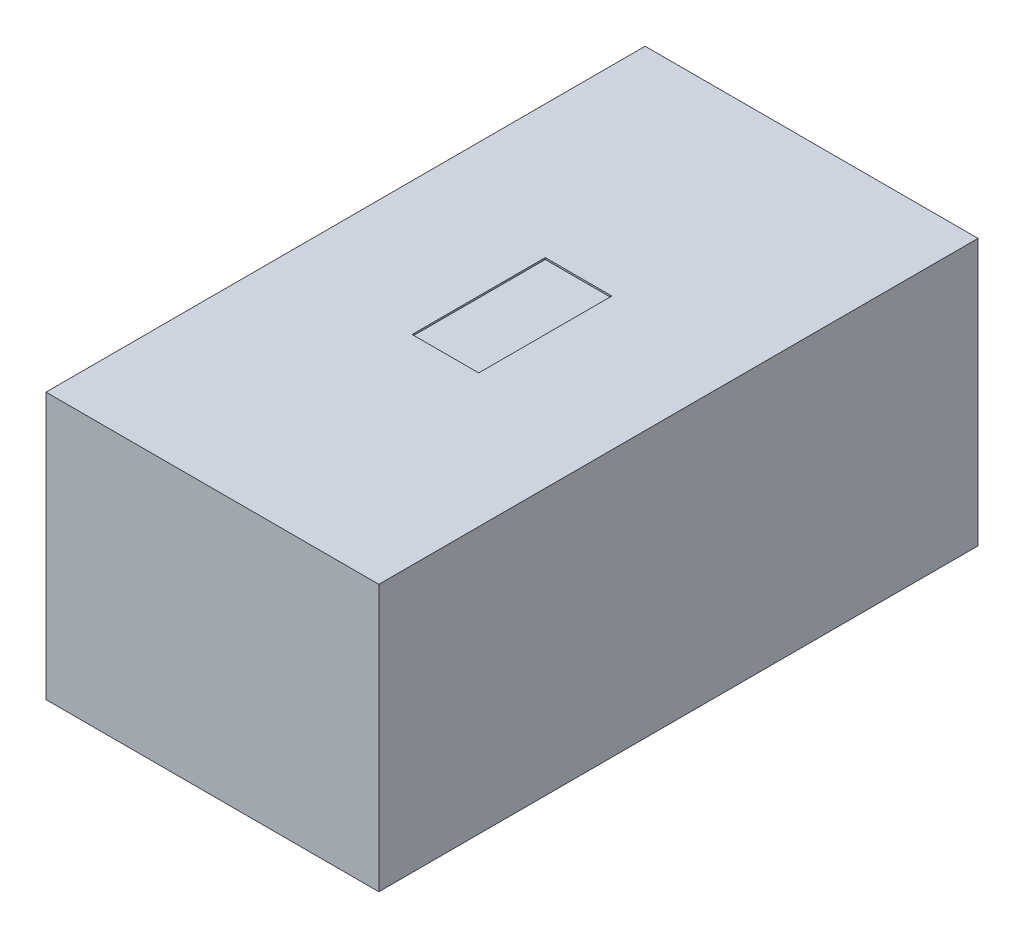
ISO-10303-21;
HEADER;
FILE_DESCRIPTION(('STEP AP214'),'2;1');
FILE_NAME('part.step','',(''),(''),'','','');
FILE_SCHEMA(('AUTOMOTIVE_DESIGN { 1 0 10303 214 1 1 1 1 }'));
ENDSEC;
DATA;
#1=APPLICATION_CONTEXT('core data for automotive mechanical design processes');
#2=APPLICATION_PROTOCOL_DEFINITION('international standard','automotive_design',2000,#1);
#3=PRODUCT_CONTEXT('',#1,'mechanical');
#4=PRODUCT('Part','Part','',(#3));
#5=PRODUCT_RELATED_PRODUCT_CATEGORY('part','',(#4));
#6=PRODUCT_DEFINITION_FORMATION('','',#4);
#7=PRODUCT_DEFINITION_CONTEXT('part definition',#1,'design');
#8=PRODUCT_DEFINITION('design','',#6,#7);
#9=PRODUCT_DEFINITION_SHAPE('','',#8);
#10=(LENGTH_UNIT() NAMED_UNIT(*) SI_UNIT(.MILLI.,.METRE.));
#11=(NAMED_UNIT(*) PLANE_ANGLE_UNIT() SI_UNIT($,.RADIAN.));
#12=(NAMED_UNIT(*) SI_UNIT($,.STERADIAN.) SOLID_ANGLE_UNIT());
#13=UNCERTAINTY_MEASURE_WITH_UNIT(LENGTH_MEASURE(1.E-05),#10,'distance_accuracy_value','');
#14=(GEOMETRIC_REPRESENTATION_CONTEXT(3) GLOBAL_UNCERTAINTY_ASSIGNED_CONTEXT((#13)) GLOBAL_UNIT_ASSIGNED_CONTEXT((#10,
#11,#12)) REPRESENTATION_CONTEXT('',''));
#15=CARTESIAN_POINT('',(0.,0.,0.));
#16=DIRECTION('',(0.,0.,1.));
#17=DIRECTION('',(1.,0.,0.));
#18=AXIS2_PLACEMENT_3D('',#15,#16,#17);
#19=CARTESIAN_POINT('',(0.5,0.8,-0.9));
#20=DIRECTION('',(-1.,0.,0.));
#21=DIRECTION('',(0.,0.,1.));
#22=AXIS2_PLACEMENT_3D('',#19,#20,#21);
#23=PLANE('',#22);
#24=DIRECTION('',(0.,0.,-1.));
#25=VECTOR('',#24,1.);
#26=CARTESIAN_POINT('',(0.5,0.,-0.9));
#27=LINE('',#26,#25);
#28=CARTESIAN_POINT('',(0.5,0.,0.9));
#29=VERTEX_POINT('',#28);
#30=CARTESIAN_POINT('',(0.5,0.,-0.9));
#31=VERTEX_POINT('',#30);
#32=EDGE_CURVE('E149',#29,#31,#27,.T.);
#33=ORIENTED_EDGE('',*,*,#32,.T.);
#34=DIRECTION('',(0.,-1.,0.));
#35=VECTOR('',#34,1.);
#36=CARTESIAN_POINT('',(0.5,0.8,-0.9));
#37=LINE('',#36,#35);
#38=CARTESIAN_POINT('',(0.5,0.8,-0.9));
#39=VERTEX_POINT('',#38);
#40=EDGE_CURVE('E11',#39,#31,#37,.T.);
#41=ORIENTED_EDGE('',*,*,#40,.F.);
#42=DIRECTION('',(0.,0.,-1.));
#43=VECTOR('',#42,1.);
#44=CARTESIAN_POINT('',(0.5,0.8,-0.9));
#45=LINE('',#44,#43);
#46=CARTESIAN_POINT('',(0.5,0.8,0.9));
#47=VERTEX_POINT('',#46);
#48=EDGE_CURVE('E153',#47,#39,#45,.T.);
#49=ORIENTED_EDGE('',*,*,#48,.F.);
#50=DIRECTION('',(0.,-1.,0.));
#51=VECTOR('',#50,1.);
#52=CARTESIAN_POINT('',(0.5,0.8,0.9));
#53=LINE('',#52,#51);
#54=EDGE_CURVE('E159',#47,#29,#53,.T.);
#55=ORIENTED_EDGE('',*,*,#54,.T.);
#56=EDGE_LOOP('',(#33,#41,#49,#55));
#57=FACE_BOUND('',#56,.T.);
#58=ADVANCED_FACE('F41',(#57),#23,.F.);
#59=CARTESIAN_POINT('',(-0.5,0.8,-0.9));
#60=DIRECTION('',(0.,0.,1.));
#61=DIRECTION('',(1.,0.,0.));
#62=AXIS2_PLACEMENT_3D('',#59,#60,#61);
#63=PLANE('',#62);
#64=DIRECTION('',(-1.,0.,0.));
#65=VECTOR('',#64,1.);
#66=CARTESIAN_POINT('',(-0.5,0.,-0.9));
#67=LINE('',#66,#65);
#68=CARTESIAN_POINT('',(-0.5,0.,-0.9));
#69=VERTEX_POINT('',#68);
#70=EDGE_CURVE('E162',#31,#69,#67,.T.);
#71=ORIENTED_EDGE('',*,*,#70,.T.);
#72=DIRECTION('',(0.,-1.,0.));
#73=VECTOR('',#72,1.);
#74=CARTESIAN_POINT('',(-0.5,0.8,-0.9));
#75=LINE('',#74,#73);
#76=CARTESIAN_POINT('',(-0.5,0.8,-0.9));
#77=VERTEX_POINT('',#76);
#78=EDGE_CURVE('E48',#77,#69,#75,.T.);
#79=ORIENTED_EDGE('',*,*,#78,.F.);
#80=DIRECTION('',(-1.,0.,0.));
#81=VECTOR('',#80,1.);
#82=CARTESIAN_POINT('',(-0.5,0.8,-0.9));
#83=LINE('',#82,#81);
#84=EDGE_CURVE('E92',#39,#77,#83,.T.);
#85=ORIENTED_EDGE('',*,*,#84,.F.);
#86=ORIENTED_EDGE('',*,*,#40,.T.);
#87=EDGE_LOOP('',(#71,#79,#85,#86));
#88=FACE_BOUND('',#87,.T.);
#89=ADVANCED_FACE('F192',(#88),#63,.F.);
#90=CARTESIAN_POINT('',(-0.5,0.8,-0.9));
#91=DIRECTION('',(1.,0.,0.));
#92=DIRECTION('',(0.,0.,-1.));
#93=AXIS2_PLACEMENT_3D('',#90,#91,#92);
#94=PLANE('',#93);
#95=DIRECTION('',(0.,0.,1.));
#96=VECTOR('',#95,1.);
#97=CARTESIAN_POINT('',(-0.5,0.,-0.9));
#98=LINE('',#97,#96);
#99=CARTESIAN_POINT('',(-0.5,0.,0.9));
#100=VERTEX_POINT('',#99);
#101=EDGE_CURVE('E164',#69,#100,#98,.T.);
#102=ORIENTED_EDGE('',*,*,#101,.T.);
#103=DIRECTION('',(0.,-1.,0.));
#104=VECTOR('',#103,1.);
#105=CARTESIAN_POINT('',(-0.5,0.8,0.9));
#106=LINE('',#105,#104);
#107=CARTESIAN_POINT('',(-0.5,0.8,0.9));
#108=VERTEX_POINT('',#107);
#109=EDGE_CURVE('E168',#108,#100,#106,.T.);
#110=ORIENTED_EDGE('',*,*,#109,.F.);
#111=DIRECTION('',(0.,0.,1.));
#112=VECTOR('',#111,1.);
#113=CARTESIAN_POINT('',(-0.5,0.8,-0.9));
#114=LINE('',#113,#112);
#115=EDGE_CURVE('E156',#77,#108,#114,.T.);
#116=ORIENTED_EDGE('',*,*,#115,.F.);
#117=ORIENTED_EDGE('',*,*,#78,.T.);
#118=EDGE_LOOP('',(#102,#110,#116,#117));
#119=FACE_BOUND('',#118,.T.);
#120=ADVANCED_FACE('F173',(#119),#94,.F.);
#121=CARTESIAN_POINT('',(-0.5,0.8,0.9));
#122=DIRECTION('',(0.,0.,-1.));
#123=DIRECTION('',(-1.,0.,0.));
#124=AXIS2_PLACEMENT_3D('',#121,#122,#123);
#125=PLANE('',#124);
#126=DIRECTION('',(1.,0.,0.));
#127=VECTOR('',#126,1.);
#128=CARTESIAN_POINT('',(-0.5,0.,0.9));
#129=LINE('',#128,#127);
#130=EDGE_CURVE('E85',#100,#29,#129,.T.);
#131=ORIENTED_EDGE('',*,*,#130,.T.);
#132=ORIENTED_EDGE('',*,*,#54,.F.);
#133=DIRECTION('',(1.,0.,0.));
#134=VECTOR('',#133,1.);
#135=CARTESIAN_POINT('',(-0.5,0.8,0.9));
#136=LINE('',#135,#134);
#137=EDGE_CURVE('E64',#108,#47,#136,.T.);
#138=ORIENTED_EDGE('',*,*,#137,.F.);
#139=ORIENTED_EDGE('',*,*,#109,.T.);
#140=EDGE_LOOP('',(#131,#132,#138,#139));
#141=FACE_BOUND('',#140,.T.);
#142=ADVANCED_FACE('F181',(#141),#125,.F.);
#143=CARTESIAN_POINT('',(0.,0.8,0.));
#144=DIRECTION('',(0.,1.,0.));
#145=DIRECTION('',(0.,0.,1.));
#146=AXIS2_PLACEMENT_3D('',#143,#144,#145);
#147=PLANE('',#146);
#148=DIRECTION('',(0.,0.,-1.));
#149=VECTOR('',#148,1.);
#150=CARTESIAN_POINT('',(0.1,0.8,-0.2));
#151=LINE('',#150,#149);
#152=CARTESIAN_POINT('',(0.1,0.8,0.2));
#153=VERTEX_POINT('',#152);
#154=CARTESIAN_POINT('',(0.1,0.8,-0.2));
#155=VERTEX_POINT('',#154);
#156=EDGE_CURVE('E55',#153,#155,#151,.T.);
#157=ORIENTED_EDGE('',*,*,#156,.F.);
#158=DIRECTION('',(1.,0.,0.));
#159=VECTOR('',#158,1.);
#160=CARTESIAN_POINT('',(-0.1,0.8,0.2));
#161=LINE('',#160,#159);
#162=CARTESIAN_POINT('',(-0.1,0.8,0.2));
#163=VERTEX_POINT('',#162);
#164=EDGE_CURVE('E134',#163,#153,#161,.T.);
#165=ORIENTED_EDGE('',*,*,#164,.F.);
#166=DIRECTION('',(0.,0.,1.));
#167=VECTOR('',#166,1.);
#168=CARTESIAN_POINT('',(-0.1,0.8,-0.2));
#169=LINE('',#168,#167);
#170=CARTESIAN_POINT('',(-0.1,0.8,-0.2));
#171=VERTEX_POINT('',#170);
#172=EDGE_CURVE('E137',#171,#163,#169,.T.);
#173=ORIENTED_EDGE('',*,*,#172,.F.);
#174=DIRECTION('',(-1.,0.,0.));
#175=VECTOR('',#174,1.);
#176=CARTESIAN_POINT('',(-0.1,0.8,-0.2));
#177=LINE('',#176,#175);
#178=EDGE_CURVE('E143',#155,#171,#177,.T.);
#179=ORIENTED_EDGE('',*,*,#178,.F.);
#180=EDGE_LOOP('',(#157,#165,#173,#179));
#181=FACE_BOUND('',#180,.T.);
#182=ORIENTED_EDGE('',*,*,#48,.T.);
#183=ORIENTED_EDGE('',*,*,#84,.T.);
#184=ORIENTED_EDGE('',*,*,#115,.T.);
#185=ORIENTED_EDGE('',*,*,#137,.T.);
#186=EDGE_LOOP('',(#182,#183,#184,#185));
#187=FACE_BOUND('',#186,.T.);
#188=ADVANCED_FACE('F183',(#181,#187),#147,.T.);
#189=CARTESIAN_POINT('',(0.,0.,0.));
#190=DIRECTION('',(0.,1.,0.));
#191=DIRECTION('',(0.,0.,1.));
#192=AXIS2_PLACEMENT_3D('',#189,#190,#191);
#193=PLANE('',#192);
#194=ORIENTED_EDGE('',*,*,#32,.F.);
#195=ORIENTED_EDGE('',*,*,#130,.F.);
#196=ORIENTED_EDGE('',*,*,#101,.F.);
#197=ORIENTED_EDGE('',*,*,#70,.F.);
#198=EDGE_LOOP('',(#194,#195,#196,#197));
#199=FACE_BOUND('',#198,.T.);
#200=ADVANCED_FACE('F177',(#199),#193,.F.);
#201=CARTESIAN_POINT('',(0.1,0.795,-0.2));
#202=DIRECTION('',(1.,0.,0.));
#203=DIRECTION('',(0.,0.,-1.));
#204=AXIS2_PLACEMENT_3D('',#201,#202,#203);
#205=PLANE('',#204);
#206=ORIENTED_EDGE('',*,*,#156,.T.);
#207=DIRECTION('',(0.,1.,0.));
#208=VECTOR('',#207,1.);
#209=CARTESIAN_POINT('',(0.1,0.795,-0.2));
#210=LINE('',#209,#208);
#211=CARTESIAN_POINT('',(0.1,0.795,-0.2));
#212=VERTEX_POINT('',#211);
#213=EDGE_CURVE('E112',#212,#155,#210,.T.);
#214=ORIENTED_EDGE('',*,*,#213,.F.);
#215=DIRECTION('',(0.,0.,-1.));
#216=VECTOR('',#215,1.);
#217=CARTESIAN_POINT('',(0.1,0.795,-0.2));
#218=LINE('',#217,#216);
#219=CARTESIAN_POINT('',(0.1,0.795,0.2));
#220=VERTEX_POINT('',#219);
#221=EDGE_CURVE('E116',#220,#212,#218,.T.);
#222=ORIENTED_EDGE('',*,*,#221,.F.);
#223=DIRECTION('',(0.,1.,0.));
#224=VECTOR('',#223,1.);
#225=CARTESIAN_POINT('',(0.1,0.795,0.2));
#226=LINE('',#225,#224);
#227=EDGE_CURVE('E147',#220,#153,#226,.T.);
#228=ORIENTED_EDGE('',*,*,#227,.T.);
#229=EDGE_LOOP('',(#206,#214,#222,#228));
#230=FACE_BOUND('',#229,.T.);
#231=ADVANCED_FACE('F114',(#230),#205,.F.);
#232=CARTESIAN_POINT('',(-0.1,0.795,0.2));
#233=DIRECTION('',(0.,0.,1.));
#234=DIRECTION('',(1.,0.,0.));
#235=AXIS2_PLACEMENT_3D('',#232,#233,#234);
#236=PLANE('',#235);
#237=ORIENTED_EDGE('',*,*,#164,.T.);
#238=ORIENTED_EDGE('',*,*,#227,.F.);
#239=DIRECTION('',(1.,0.,0.));
#240=VECTOR('',#239,1.);
#241=CARTESIAN_POINT('',(-0.1,0.795,0.2));
#242=LINE('',#241,#240);
#243=CARTESIAN_POINT('',(-0.1,0.795,0.2));
#244=VERTEX_POINT('',#243);
#245=EDGE_CURVE('E122',#244,#220,#242,.T.);
#246=ORIENTED_EDGE('',*,*,#245,.F.);
#247=DIRECTION('',(0.,1.,0.));
#248=VECTOR('',#247,1.);
#249=CARTESIAN_POINT('',(-0.1,0.795,0.2));
#250=LINE('',#249,#248);
#251=EDGE_CURVE('E150',#244,#163,#250,.T.);
#252=ORIENTED_EDGE('',*,*,#251,.T.);
#253=EDGE_LOOP('',(#237,#238,#246,#252));
#254=FACE_BOUND('',#253,.T.);
#255=ADVANCED_FACE('F223',(#254),#236,.F.);
#256=CARTESIAN_POINT('',(-0.1,0.795,-0.2));
#257=DIRECTION('',(-1.,0.,0.));
#258=DIRECTION('',(0.,0.,1.));
#259=AXIS2_PLACEMENT_3D('',#256,#257,#258);
#260=PLANE('',#259);
#261=ORIENTED_EDGE('',*,*,#172,.T.);
#262=ORIENTED_EDGE('',*,*,#251,.F.);
#263=DIRECTION('',(0.,0.,1.));
#264=VECTOR('',#263,1.);
#265=CARTESIAN_POINT('',(-0.1,0.795,-0.2));
#266=LINE('',#265,#264);
#267=CARTESIAN_POINT('',(-0.1,0.795,-0.2));
#268=VERTEX_POINT('',#267);
#269=EDGE_CURVE('E130',#268,#244,#266,.T.);
#270=ORIENTED_EDGE('',*,*,#269,.F.);
#271=DIRECTION('',(0.,1.,0.));
#272=VECTOR('',#271,1.);
#273=CARTESIAN_POINT('',(-0.1,0.795,-0.2));
#274=LINE('',#273,#272);
#275=EDGE_CURVE('E121',#268,#171,#274,.T.);
#276=ORIENTED_EDGE('',*,*,#275,.T.);
#277=EDGE_LOOP('',(#261,#262,#270,#276));
#278=FACE_BOUND('',#277,.T.);
#279=ADVANCED_FACE('F232',(#278),#260,.F.);
#280=CARTESIAN_POINT('',(-0.1,0.795,-0.2));
#281=DIRECTION('',(0.,0.,-1.));
#282=DIRECTION('',(-1.,0.,0.));
#283=AXIS2_PLACEMENT_3D('',#280,#281,#282);
#284=PLANE('',#283);
#285=ORIENTED_EDGE('',*,*,#178,.T.);
#286=ORIENTED_EDGE('',*,*,#275,.F.);
#287=DIRECTION('',(-1.,0.,0.));
#288=VECTOR('',#287,1.);
#289=CARTESIAN_POINT('',(-0.1,0.795,-0.2));
#290=LINE('',#289,#288);
#291=EDGE_CURVE('E125',#212,#268,#290,.T.);
#292=ORIENTED_EDGE('',*,*,#291,.F.);
#293=ORIENTED_EDGE('',*,*,#213,.T.);
#294=EDGE_LOOP('',(#285,#286,#292,#293));
#295=FACE_BOUND('',#294,.T.);
#296=ADVANCED_FACE('F126',(#295),#284,.F.);
#297=CARTESIAN_POINT('',(0.,0.795,0.));
#298=DIRECTION('',(0.,1.,0.));
#299=DIRECTION('',(0.,0.,1.));
#300=AXIS2_PLACEMENT_3D('',#297,#298,#299);
#301=PLANE('',#300);
#302=ORIENTED_EDGE('',*,*,#221,.T.);
#303=ORIENTED_EDGE('',*,*,#291,.T.);
#304=ORIENTED_EDGE('',*,*,#269,.T.);
#305=ORIENTED_EDGE('',*,*,#245,.T.);
#306=EDGE_LOOP('',(#302,#303,#304,#305));
#307=FACE_BOUND('',#306,.T.);
#308=ADVANCED_FACE('F132',(#307),#301,.T.);
#309=CLOSED_SHELL('',(#58,#89,#120,#142,#188,#200,#231,#255,#279,#296,#308));
#310=MANIFOLD_SOLID_BREP('B2',#309);
#311=ADVANCED_BREP_SHAPE_REPRESENTATION('',(#18,#310),#14);
#312=SHAPE_DEFINITION_REPRESENTATION(#9,#311);
ENDSEC;
END-ISO-10303-21;
